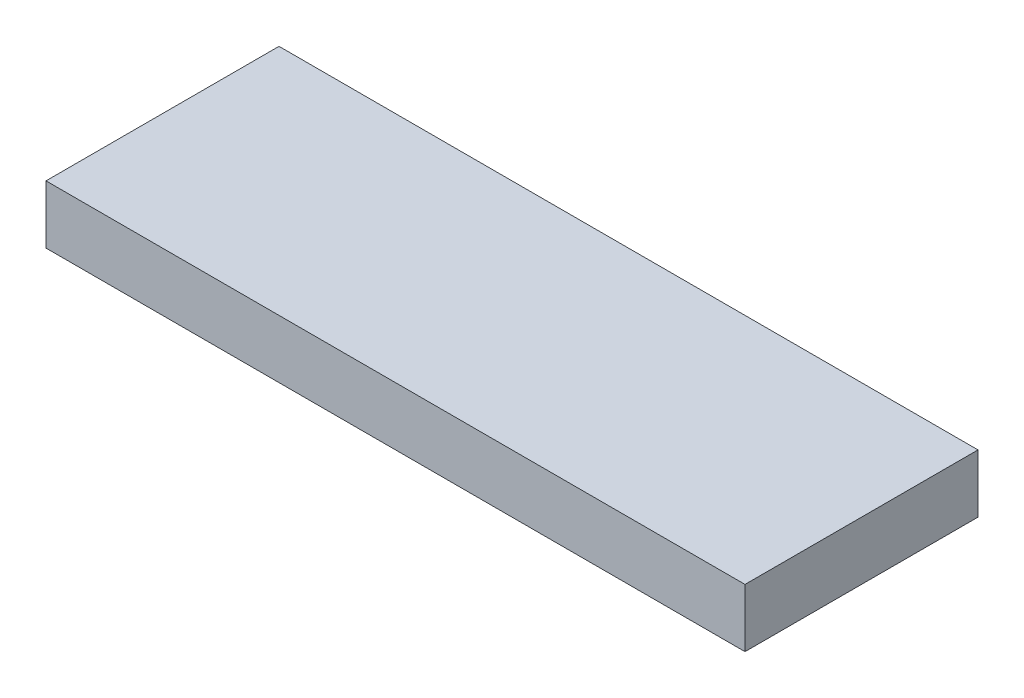
ISO-10303-21;
HEADER;
FILE_DESCRIPTION(('STEP AP214'),'2;1');
FILE_NAME('part.step','',(''),(''),'','','');
FILE_SCHEMA(('AUTOMOTIVE_DESIGN { 1 0 10303 214 1 1 1 1 }'));
ENDSEC;
DATA;
#1=APPLICATION_CONTEXT('core data for automotive mechanical design processes');
#2=APPLICATION_PROTOCOL_DEFINITION('international standard','automotive_design',2000,#1);
#3=PRODUCT_CONTEXT('',#1,'mechanical');
#4=PRODUCT('Part','Part','',(#3));
#5=PRODUCT_RELATED_PRODUCT_CATEGORY('part','',(#4));
#6=PRODUCT_DEFINITION_FORMATION('','',#4);
#7=PRODUCT_DEFINITION_CONTEXT('part definition',#1,'design');
#8=PRODUCT_DEFINITION('design','',#6,#7);
#9=PRODUCT_DEFINITION_SHAPE('','',#8);
#10=(LENGTH_UNIT() NAMED_UNIT(*) SI_UNIT(.MILLI.,.METRE.));
#11=(NAMED_UNIT(*) PLANE_ANGLE_UNIT() SI_UNIT($,.RADIAN.));
#12=(NAMED_UNIT(*) SI_UNIT($,.STERADIAN.) SOLID_ANGLE_UNIT());
#13=UNCERTAINTY_MEASURE_WITH_UNIT(LENGTH_MEASURE(1.E-05),#10,'distance_accuracy_value','');
#14=(GEOMETRIC_REPRESENTATION_CONTEXT(3) GLOBAL_UNCERTAINTY_ASSIGNED_CONTEXT((#13)) GLOBAL_UNIT_ASSIGNED_CONTEXT((#10,
#11,#12)) REPRESENTATION_CONTEXT('',''));
#15=CARTESIAN_POINT('',(0.,0.,0.));
#16=DIRECTION('',(0.,0.,1.));
#17=DIRECTION('',(1.,0.,0.));
#18=AXIS2_PLACEMENT_3D('',#15,#16,#17);
#19=CARTESIAN_POINT('',(0.,6.35,0.));
#20=DIRECTION('',(1.,0.,0.));
#21=DIRECTION('',(0.,0.,-1.));
#22=AXIS2_PLACEMENT_3D('',#19,#20,#21);
#23=PLANE('',#22);
#24=DIRECTION('',(0.,0.,1.));
#25=VECTOR('',#24,1.);
#26=CARTESIAN_POINT('',(0.,0.,0.));
#27=LINE('',#26,#25);
#28=CARTESIAN_POINT('',(0.,0.,-25.4));
#29=VERTEX_POINT('',#28);
#30=CARTESIAN_POINT('',(0.,0.,0.));
#31=VERTEX_POINT('',#30);
#32=EDGE_CURVE('E96',#29,#31,#27,.T.);
#33=ORIENTED_EDGE('',*,*,#32,.T.);
#34=DIRECTION('',(0.,-1.,0.));
#35=VECTOR('',#34,1.);
#36=CARTESIAN_POINT('',(0.,6.35,0.));
#37=LINE('',#36,#35);
#38=CARTESIAN_POINT('',(0.,6.35,0.));
#39=VERTEX_POINT('',#38);
#40=EDGE_CURVE('E11',#39,#31,#37,.T.);
#41=ORIENTED_EDGE('',*,*,#40,.F.);
#42=DIRECTION('',(0.,0.,1.));
#43=VECTOR('',#42,1.);
#44=CARTESIAN_POINT('',(0.,6.35,0.));
#45=LINE('',#44,#43);
#46=CARTESIAN_POINT('',(0.,6.35,-25.4));
#47=VERTEX_POINT('',#46);
#48=EDGE_CURVE('E84',#47,#39,#45,.T.);
#49=ORIENTED_EDGE('',*,*,#48,.F.);
#50=DIRECTION('',(0.,-1.,0.));
#51=VECTOR('',#50,1.);
#52=CARTESIAN_POINT('',(0.,6.35,-25.4));
#53=LINE('',#52,#51);
#54=EDGE_CURVE('E92',#47,#29,#53,.T.);
#55=ORIENTED_EDGE('',*,*,#54,.T.);
#56=EDGE_LOOP('',(#33,#41,#49,#55));
#57=FACE_BOUND('',#56,.T.);
#58=ADVANCED_FACE('F33',(#57),#23,.F.);
#59=CARTESIAN_POINT('',(0.,6.35,0.));
#60=DIRECTION('',(0.,0.,-1.));
#61=DIRECTION('',(-1.,0.,0.));
#62=AXIS2_PLACEMENT_3D('',#59,#60,#61);
#63=PLANE('',#62);
#64=DIRECTION('',(1.,0.,0.));
#65=VECTOR('',#64,1.);
#66=CARTESIAN_POINT('',(0.,0.,0.));
#67=LINE('',#66,#65);
#68=CARTESIAN_POINT('',(76.2,0.,0.));
#69=VERTEX_POINT('',#68);
#70=EDGE_CURVE('E88',#31,#69,#67,.T.);
#71=ORIENTED_EDGE('',*,*,#70,.T.);
#72=DIRECTION('',(0.,-1.,0.));
#73=VECTOR('',#72,1.);
#74=CARTESIAN_POINT('',(76.2,6.35,0.));
#75=LINE('',#74,#73);
#76=CARTESIAN_POINT('',(76.2,6.35,0.));
#77=VERTEX_POINT('',#76);
#78=EDGE_CURVE('E41',#77,#69,#75,.T.);
#79=ORIENTED_EDGE('',*,*,#78,.F.);
#80=DIRECTION('',(1.,0.,0.));
#81=VECTOR('',#80,1.);
#82=CARTESIAN_POINT('',(0.,6.35,0.));
#83=LINE('',#82,#81);
#84=EDGE_CURVE('E79',#39,#77,#83,.T.);
#85=ORIENTED_EDGE('',*,*,#84,.F.);
#86=ORIENTED_EDGE('',*,*,#40,.T.);
#87=EDGE_LOOP('',(#71,#79,#85,#86));
#88=FACE_BOUND('',#87,.T.);
#89=ADVANCED_FACE('F87',(#88),#63,.F.);
#90=CARTESIAN_POINT('',(76.2,6.35,0.));
#91=DIRECTION('',(-1.,0.,0.));
#92=DIRECTION('',(0.,0.,1.));
#93=AXIS2_PLACEMENT_3D('',#90,#91,#92);
#94=PLANE('',#93);
#95=DIRECTION('',(0.,0.,-1.));
#96=VECTOR('',#95,1.);
#97=CARTESIAN_POINT('',(76.2,0.,0.));
#98=LINE('',#97,#96);
#99=CARTESIAN_POINT('',(76.2,0.,-25.4));
#100=VERTEX_POINT('',#99);
#101=EDGE_CURVE('E66',#69,#100,#98,.T.);
#102=ORIENTED_EDGE('',*,*,#101,.T.);
#103=DIRECTION('',(0.,-1.,0.));
#104=VECTOR('',#103,1.);
#105=CARTESIAN_POINT('',(76.2,6.35,-25.4));
#106=LINE('',#105,#104);
#107=CARTESIAN_POINT('',(76.2,6.35,-25.4));
#108=VERTEX_POINT('',#107);
#109=EDGE_CURVE('E89',#108,#100,#106,.T.);
#110=ORIENTED_EDGE('',*,*,#109,.F.);
#111=DIRECTION('',(0.,0.,-1.));
#112=VECTOR('',#111,1.);
#113=CARTESIAN_POINT('',(76.2,6.35,0.));
#114=LINE('',#113,#112);
#115=EDGE_CURVE('E82',#77,#108,#114,.T.);
#116=ORIENTED_EDGE('',*,*,#115,.F.);
#117=ORIENTED_EDGE('',*,*,#78,.T.);
#118=EDGE_LOOP('',(#102,#110,#116,#117));
#119=FACE_BOUND('',#118,.T.);
#120=ADVANCED_FACE('F90',(#119),#94,.F.);
#121=CARTESIAN_POINT('',(0.,6.35,-25.4));
#122=DIRECTION('',(0.,0.,1.));
#123=DIRECTION('',(1.,0.,0.));
#124=AXIS2_PLACEMENT_3D('',#121,#122,#123);
#125=PLANE('',#124);
#126=DIRECTION('',(-1.,0.,0.));
#127=VECTOR('',#126,1.);
#128=CARTESIAN_POINT('',(0.,0.,-25.4));
#129=LINE('',#128,#127);
#130=EDGE_CURVE('E72',#100,#29,#129,.T.);
#131=ORIENTED_EDGE('',*,*,#130,.T.);
#132=ORIENTED_EDGE('',*,*,#54,.F.);
#133=DIRECTION('',(-1.,0.,0.));
#134=VECTOR('',#133,1.);
#135=CARTESIAN_POINT('',(0.,6.35,-25.4));
#136=LINE('',#135,#134);
#137=EDGE_CURVE('E49',#108,#47,#136,.T.);
#138=ORIENTED_EDGE('',*,*,#137,.F.);
#139=ORIENTED_EDGE('',*,*,#109,.T.);
#140=EDGE_LOOP('',(#131,#132,#138,#139));
#141=FACE_BOUND('',#140,.T.);
#142=ADVANCED_FACE('F103',(#141),#125,.F.);
#143=CARTESIAN_POINT('',(0.,6.35,0.));
#144=DIRECTION('',(0.,-1.,0.));
#145=DIRECTION('',(0.,0.,-1.));
#146=AXIS2_PLACEMENT_3D('',#143,#144,#145);
#147=PLANE('',#146);
#148=ORIENTED_EDGE('',*,*,#48,.T.);
#149=ORIENTED_EDGE('',*,*,#84,.T.);
#150=ORIENTED_EDGE('',*,*,#115,.T.);
#151=ORIENTED_EDGE('',*,*,#137,.T.);
#152=EDGE_LOOP('',(#148,#149,#150,#151));
#153=FACE_BOUND('',#152,.T.);
#154=ADVANCED_FACE('F80',(#153),#147,.F.);
#155=CARTESIAN_POINT('',(0.,0.,0.));
#156=DIRECTION('',(0.,-1.,0.));
#157=DIRECTION('',(0.,0.,-1.));
#158=AXIS2_PLACEMENT_3D('',#155,#156,#157);
#159=PLANE('',#158);
#160=ORIENTED_EDGE('',*,*,#32,.F.);
#161=ORIENTED_EDGE('',*,*,#130,.F.);
#162=ORIENTED_EDGE('',*,*,#101,.F.);
#163=ORIENTED_EDGE('',*,*,#70,.F.);
#164=EDGE_LOOP('',(#160,#161,#162,#163));
#165=FACE_BOUND('',#164,.T.);
#166=ADVANCED_FACE('F106',(#165),#159,.T.);
#167=CLOSED_SHELL('',(#58,#89,#120,#142,#154,#166));
#168=MANIFOLD_SOLID_BREP('B2',#167);
#169=ADVANCED_BREP_SHAPE_REPRESENTATION('',(#18,#168),#14);
#170=SHAPE_DEFINITION_REPRESENTATION(#9,#169);
ENDSEC;
END-ISO-10303-21;
